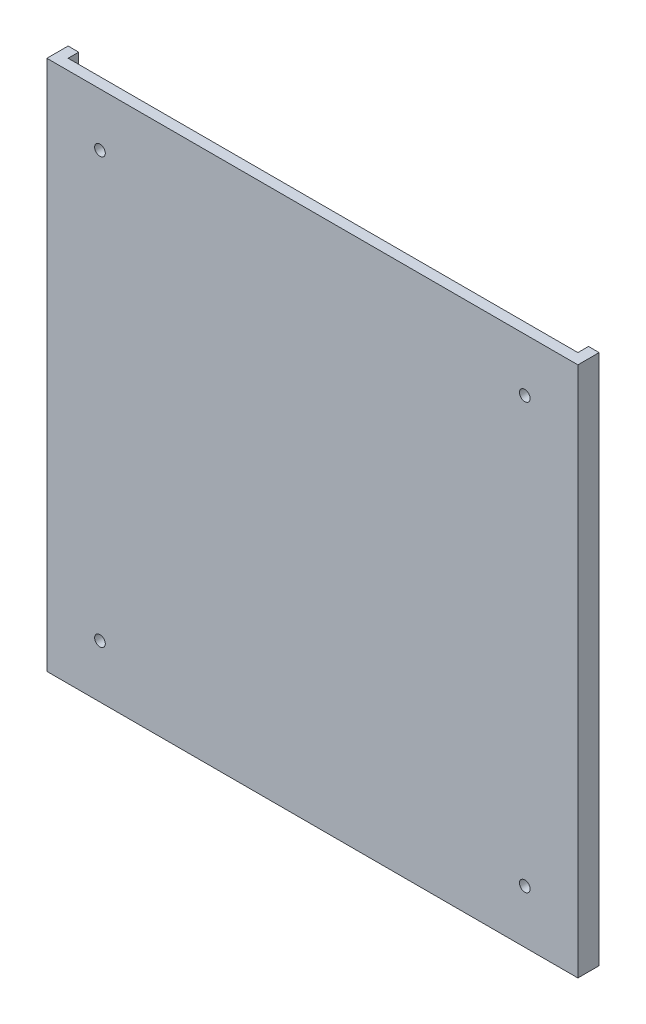
ISO-10303-21;
HEADER;
FILE_DESCRIPTION(('STEP AP214'),'2;1');
FILE_NAME('part.step','',(''),(''),'','','');
FILE_SCHEMA(('AUTOMOTIVE_DESIGN { 1 0 10303 214 1 1 1 1 }'));
ENDSEC;
DATA;
#1=APPLICATION_CONTEXT('core data for automotive mechanical design processes');
#2=APPLICATION_PROTOCOL_DEFINITION('international standard','automotive_design',2000,#1);
#3=PRODUCT_CONTEXT('',#1,'mechanical');
#4=PRODUCT('Part','Part','',(#3));
#5=PRODUCT_RELATED_PRODUCT_CATEGORY('part','',(#4));
#6=PRODUCT_DEFINITION_FORMATION('','',#4);
#7=PRODUCT_DEFINITION_CONTEXT('part definition',#1,'design');
#8=PRODUCT_DEFINITION('design','',#6,#7);
#9=PRODUCT_DEFINITION_SHAPE('','',#8);
#10=(LENGTH_UNIT() NAMED_UNIT(*) SI_UNIT(.MILLI.,.METRE.));
#11=(NAMED_UNIT(*) PLANE_ANGLE_UNIT() SI_UNIT($,.RADIAN.));
#12=(NAMED_UNIT(*) SI_UNIT($,.STERADIAN.) SOLID_ANGLE_UNIT());
#13=UNCERTAINTY_MEASURE_WITH_UNIT(LENGTH_MEASURE(1.E-05),#10,'distance_accuracy_value','');
#14=(GEOMETRIC_REPRESENTATION_CONTEXT(3) GLOBAL_UNCERTAINTY_ASSIGNED_CONTEXT((#13)) GLOBAL_UNIT_ASSIGNED_CONTEXT((#10,
#11,#12)) REPRESENTATION_CONTEXT('',''));
#15=CARTESIAN_POINT('',(0.,0.,0.));
#16=DIRECTION('',(0.,0.,1.));
#17=DIRECTION('',(1.,0.,0.));
#18=AXIS2_PLACEMENT_3D('',#15,#16,#17);
#19=CARTESIAN_POINT('',(0.,0.,0.));
#20=DIRECTION('',(0.,0.,-1.));
#21=DIRECTION('',(-1.,0.,0.));
#22=AXIS2_PLACEMENT_3D('',#19,#20,#21);
#23=PLANE('',#22);
#24=DIRECTION('',(0.,1.,0.));
#25=VECTOR('',#24,1.);
#26=CARTESIAN_POINT('',(-240.,-250.,0.));
#27=LINE('',#26,#25);
#28=CARTESIAN_POINT('',(-240.,-250.,0.));
#29=VERTEX_POINT('',#28);
#30=CARTESIAN_POINT('',(-240.,250.,0.));
#31=VERTEX_POINT('',#30);
#32=EDGE_CURVE('E143',#29,#31,#27,.T.);
#33=ORIENTED_EDGE('',*,*,#32,.F.);
#34=DIRECTION('',(1.,0.,0.));
#35=VECTOR('',#34,1.);
#36=CARTESIAN_POINT('',(-250.,-250.,0.));
#37=LINE('',#36,#35);
#38=CARTESIAN_POINT('',(-250.,-250.,0.));
#39=VERTEX_POINT('',#38);
#40=EDGE_CURVE('E131',#39,#29,#37,.T.);
#41=ORIENTED_EDGE('',*,*,#40,.F.);
#42=DIRECTION('',(0.,-1.,0.));
#43=VECTOR('',#42,1.);
#44=CARTESIAN_POINT('',(-250.,-250.,0.));
#45=LINE('',#44,#43);
#46=CARTESIAN_POINT('',(-250.,250.,0.));
#47=VERTEX_POINT('',#46);
#48=EDGE_CURVE('E162',#47,#39,#45,.T.);
#49=ORIENTED_EDGE('',*,*,#48,.F.);
#50=DIRECTION('',(-1.,0.,0.));
#51=VECTOR('',#50,1.);
#52=CARTESIAN_POINT('',(-250.,250.,0.));
#53=LINE('',#52,#51);
#54=EDGE_CURVE('E158',#31,#47,#53,.T.);
#55=ORIENTED_EDGE('',*,*,#54,.F.);
#56=EDGE_LOOP('',(#33,#41,#49,#55));
#57=FACE_BOUND('',#56,.T.);
#58=ADVANCED_FACE('F35',(#57),#23,.T.);
#59=CARTESIAN_POINT('',(250.,-250.,20.));
#60=DIRECTION('',(-1.,0.,0.));
#61=DIRECTION('',(0.,0.,1.));
#62=AXIS2_PLACEMENT_3D('',#59,#60,#61);
#63=PLANE('',#62);
#64=DIRECTION('',(0.,1.,0.));
#65=VECTOR('',#64,1.);
#66=CARTESIAN_POINT('',(250.,-250.,0.));
#67=LINE('',#66,#65);
#68=CARTESIAN_POINT('',(250.,-250.,0.));
#69=VERTEX_POINT('',#68);
#70=CARTESIAN_POINT('',(250.,250.,0.));
#71=VERTEX_POINT('',#70);
#72=EDGE_CURVE('E145',#69,#71,#67,.T.);
#73=ORIENTED_EDGE('',*,*,#72,.T.);
#74=DIRECTION('',(0.,0.,-1.));
#75=VECTOR('',#74,1.);
#76=CARTESIAN_POINT('',(250.,250.,20.));
#77=LINE('',#76,#75);
#78=CARTESIAN_POINT('',(250.,250.,20.));
#79=VERTEX_POINT('',#78);
#80=EDGE_CURVE('E11',#79,#71,#77,.T.);
#81=ORIENTED_EDGE('',*,*,#80,.F.);
#82=DIRECTION('',(0.,1.,0.));
#83=VECTOR('',#82,1.);
#84=CARTESIAN_POINT('',(250.,-250.,20.));
#85=LINE('',#84,#83);
#86=CARTESIAN_POINT('',(250.,-250.,20.));
#87=VERTEX_POINT('',#86);
#88=EDGE_CURVE('E149',#87,#79,#85,.T.);
#89=ORIENTED_EDGE('',*,*,#88,.F.);
#90=DIRECTION('',(0.,0.,-1.));
#91=VECTOR('',#90,1.);
#92=CARTESIAN_POINT('',(250.,-250.,20.));
#93=LINE('',#92,#91);
#94=EDGE_CURVE('E155',#87,#69,#93,.T.);
#95=ORIENTED_EDGE('',*,*,#94,.T.);
#96=EDGE_LOOP('',(#73,#81,#89,#95));
#97=FACE_BOUND('',#96,.T.);
#98=ADVANCED_FACE('F37',(#97),#63,.F.);
#99=CARTESIAN_POINT('',(-250.,250.,20.));
#100=DIRECTION('',(0.,-1.,0.));
#101=DIRECTION('',(0.,0.,-1.));
#102=AXIS2_PLACEMENT_3D('',#99,#100,#101);
#103=PLANE('',#102);
#104=DIRECTION('',(1.,0.,0.));
#105=VECTOR('',#104,1.);
#106=CARTESIAN_POINT('',(-240.,250.,10.));
#107=LINE('',#106,#105);
#108=CARTESIAN_POINT('',(-240.,250.,10.));
#109=VERTEX_POINT('',#108);
#110=CARTESIAN_POINT('',(240.,250.,10.));
#111=VERTEX_POINT('',#110);
#112=EDGE_CURVE('E133',#109,#111,#107,.T.);
#113=ORIENTED_EDGE('',*,*,#112,.F.);
#114=DIRECTION('',(0.,0.,1.));
#115=VECTOR('',#114,1.);
#116=CARTESIAN_POINT('',(-240.,250.,0.));
#117=LINE('',#116,#115);
#118=EDGE_CURVE('E115',#31,#109,#117,.T.);
#119=ORIENTED_EDGE('',*,*,#118,.F.);
#120=ORIENTED_EDGE('',*,*,#54,.T.);
#121=DIRECTION('',(0.,0.,-1.));
#122=VECTOR('',#121,1.);
#123=CARTESIAN_POINT('',(-250.,250.,20.));
#124=LINE('',#123,#122);
#125=CARTESIAN_POINT('',(-250.,250.,20.));
#126=VERTEX_POINT('',#125);
#127=EDGE_CURVE('E43',#126,#47,#124,.T.);
#128=ORIENTED_EDGE('',*,*,#127,.F.);
#129=DIRECTION('',(-1.,0.,0.));
#130=VECTOR('',#129,1.);
#131=CARTESIAN_POINT('',(-250.,250.,20.));
#132=LINE('',#131,#130);
#133=EDGE_CURVE('E87',#79,#126,#132,.T.);
#134=ORIENTED_EDGE('',*,*,#133,.F.);
#135=ORIENTED_EDGE('',*,*,#80,.T.);
#136=CARTESIAN_POINT('',(240.,250.,0.));
#137=VERTEX_POINT('',#136);
#138=EDGE_CURVE('E159',#71,#137,#53,.T.);
#139=ORIENTED_EDGE('',*,*,#138,.T.);
#140=DIRECTION('',(0.,0.,-1.));
#141=VECTOR('',#140,1.);
#142=CARTESIAN_POINT('',(240.,250.,0.));
#143=LINE('',#142,#141);
#144=EDGE_CURVE('E50',#111,#137,#143,.T.);
#145=ORIENTED_EDGE('',*,*,#144,.F.);
#146=EDGE_LOOP('',(#113,#119,#120,#128,#134,#135,#139,#145));
#147=FACE_BOUND('',#146,.T.);
#148=ADVANCED_FACE('F175',(#147),#103,.F.);
#149=CARTESIAN_POINT('',(-250.,-250.,20.));
#150=DIRECTION('',(1.,0.,0.));
#151=DIRECTION('',(0.,0.,-1.));
#152=AXIS2_PLACEMENT_3D('',#149,#150,#151);
#153=PLANE('',#152);
#154=ORIENTED_EDGE('',*,*,#48,.T.);
#155=DIRECTION('',(0.,0.,-1.));
#156=VECTOR('',#155,1.);
#157=CARTESIAN_POINT('',(-250.,-250.,20.));
#158=LINE('',#157,#156);
#159=CARTESIAN_POINT('',(-250.,-250.,20.));
#160=VERTEX_POINT('',#159);
#161=EDGE_CURVE('E166',#160,#39,#158,.T.);
#162=ORIENTED_EDGE('',*,*,#161,.F.);
#163=DIRECTION('',(0.,-1.,0.));
#164=VECTOR('',#163,1.);
#165=CARTESIAN_POINT('',(-250.,-250.,20.));
#166=LINE('',#165,#164);
#167=EDGE_CURVE('E152',#126,#160,#166,.T.);
#168=ORIENTED_EDGE('',*,*,#167,.F.);
#169=ORIENTED_EDGE('',*,*,#127,.T.);
#170=EDGE_LOOP('',(#154,#162,#168,#169));
#171=FACE_BOUND('',#170,.T.);
#172=ADVANCED_FACE('F171',(#171),#153,.F.);
#173=CARTESIAN_POINT('',(-250.,-250.,20.));
#174=DIRECTION('',(0.,1.,0.));
#175=DIRECTION('',(0.,0.,1.));
#176=AXIS2_PLACEMENT_3D('',#173,#174,#175);
#177=PLANE('',#176);
#178=ORIENTED_EDGE('',*,*,#40,.T.);
#179=DIRECTION('',(0.,0.,1.));
#180=VECTOR('',#179,1.);
#181=CARTESIAN_POINT('',(-240.,-250.,0.));
#182=LINE('',#181,#180);
#183=CARTESIAN_POINT('',(-240.,-250.,10.));
#184=VERTEX_POINT('',#183);
#185=EDGE_CURVE('E112',#29,#184,#182,.T.);
#186=ORIENTED_EDGE('',*,*,#185,.T.);
#187=DIRECTION('',(1.,0.,0.));
#188=VECTOR('',#187,1.);
#189=CARTESIAN_POINT('',(-240.,-250.,10.));
#190=LINE('',#189,#188);
#191=CARTESIAN_POINT('',(240.,-250.,10.));
#192=VERTEX_POINT('',#191);
#193=EDGE_CURVE('E123',#184,#192,#190,.T.);
#194=ORIENTED_EDGE('',*,*,#193,.T.);
#195=DIRECTION('',(0.,0.,-1.));
#196=VECTOR('',#195,1.);
#197=CARTESIAN_POINT('',(240.,-250.,0.));
#198=LINE('',#197,#196);
#199=CARTESIAN_POINT('',(240.,-250.,0.));
#200=VERTEX_POINT('',#199);
#201=EDGE_CURVE('E120',#192,#200,#198,.T.);
#202=ORIENTED_EDGE('',*,*,#201,.T.);
#203=EDGE_CURVE('E80',#200,#69,#37,.T.);
#204=ORIENTED_EDGE('',*,*,#203,.T.);
#205=ORIENTED_EDGE('',*,*,#94,.F.);
#206=DIRECTION('',(1.,0.,0.));
#207=VECTOR('',#206,1.);
#208=CARTESIAN_POINT('',(-250.,-250.,20.));
#209=LINE('',#208,#207);
#210=EDGE_CURVE('E59',#160,#87,#209,.T.);
#211=ORIENTED_EDGE('',*,*,#210,.F.);
#212=ORIENTED_EDGE('',*,*,#161,.T.);
#213=EDGE_LOOP('',(#178,#186,#194,#202,#204,#205,#211,#212));
#214=FACE_BOUND('',#213,.T.);
#215=ADVANCED_FACE('F128',(#214),#177,.F.);
#216=CARTESIAN_POINT('',(0.,0.,20.));
#217=DIRECTION('',(0.,0.,-1.));
#218=DIRECTION('',(-1.,0.,0.));
#219=AXIS2_PLACEMENT_3D('',#216,#217,#218);
#220=PLANE('',#219);
#221=CARTESIAN_POINT('',(200.,-200.,20.));
#222=DIRECTION('',(0.,0.,1.));
#223=DIRECTION('',(1.,0.,0.));
#224=AXIS2_PLACEMENT_3D('',#221,#222,#223);
#225=CIRCLE('',#224,4.99999999999999);
#226=CARTESIAN_POINT('',(205.,-200.,20.));
#227=VERTEX_POINT('',#226);
#228=EDGE_CURVE('E214',#227,#227,#225,.T.);
#229=ORIENTED_EDGE('',*,*,#228,.F.);
#230=EDGE_LOOP('',(#229));
#231=FACE_BOUND('',#230,.T.);
#232=CARTESIAN_POINT('',(-200.,-200.,20.));
#233=DIRECTION('',(0.,0.,1.));
#234=DIRECTION('',(1.,0.,0.));
#235=AXIS2_PLACEMENT_3D('',#232,#233,#234);
#236=CIRCLE('',#235,4.99999999999999);
#237=CARTESIAN_POINT('',(-195.,-200.,20.));
#238=VERTEX_POINT('',#237);
#239=EDGE_CURVE('E218',#238,#238,#236,.T.);
#240=ORIENTED_EDGE('',*,*,#239,.F.);
#241=EDGE_LOOP('',(#240));
#242=FACE_BOUND('',#241,.T.);
#243=CARTESIAN_POINT('',(200.,200.,20.));
#244=DIRECTION('',(0.,0.,1.));
#245=DIRECTION('',(1.,0.,0.));
#246=AXIS2_PLACEMENT_3D('',#243,#244,#245);
#247=CIRCLE('',#246,4.99999999999999);
#248=CARTESIAN_POINT('',(205.,200.,20.));
#249=VERTEX_POINT('',#248);
#250=EDGE_CURVE('E222',#249,#249,#247,.T.);
#251=ORIENTED_EDGE('',*,*,#250,.F.);
#252=EDGE_LOOP('',(#251));
#253=FACE_BOUND('',#252,.T.);
#254=CARTESIAN_POINT('',(-200.,200.,20.));
#255=DIRECTION('',(0.,0.,1.));
#256=DIRECTION('',(1.,0.,0.));
#257=AXIS2_PLACEMENT_3D('',#254,#255,#256);
#258=CIRCLE('',#257,4.99999999999999);
#259=CARTESIAN_POINT('',(-195.,200.,20.));
#260=VERTEX_POINT('',#259);
#261=EDGE_CURVE('E136',#260,#260,#258,.T.);
#262=ORIENTED_EDGE('',*,*,#261,.F.);
#263=EDGE_LOOP('',(#262));
#264=FACE_BOUND('',#263,.T.);
#265=ORIENTED_EDGE('',*,*,#88,.T.);
#266=ORIENTED_EDGE('',*,*,#133,.T.);
#267=ORIENTED_EDGE('',*,*,#167,.T.);
#268=ORIENTED_EDGE('',*,*,#210,.T.);
#269=EDGE_LOOP('',(#265,#266,#267,#268));
#270=FACE_BOUND('',#269,.T.);
#271=ADVANCED_FACE('F202',(#231,#242,#253,#264,#270),#220,.F.);
#272=DIRECTION('',(0.,1.,0.));
#273=VECTOR('',#272,1.);
#274=CARTESIAN_POINT('',(240.,-250.,0.));
#275=LINE('',#274,#273);
#276=EDGE_CURVE('E146',#200,#137,#275,.T.);
#277=ORIENTED_EDGE('',*,*,#276,.T.);
#278=ORIENTED_EDGE('',*,*,#138,.F.);
#279=ORIENTED_EDGE('',*,*,#72,.F.);
#280=ORIENTED_EDGE('',*,*,#203,.F.);
#281=EDGE_LOOP('',(#277,#278,#279,#280));
#282=FACE_BOUND('',#281,.T.);
#283=ADVANCED_FACE('F179',(#282),#23,.T.);
#284=CARTESIAN_POINT('',(-240.,-250.,0.));
#285=DIRECTION('',(-1.,0.,0.));
#286=DIRECTION('',(0.,0.,1.));
#287=AXIS2_PLACEMENT_3D('',#284,#285,#286);
#288=PLANE('',#287);
#289=ORIENTED_EDGE('',*,*,#118,.T.);
#290=DIRECTION('',(0.,1.,0.));
#291=VECTOR('',#290,1.);
#292=CARTESIAN_POINT('',(-240.,-250.,10.));
#293=LINE('',#292,#291);
#294=EDGE_CURVE('E108',#184,#109,#293,.T.);
#295=ORIENTED_EDGE('',*,*,#294,.F.);
#296=ORIENTED_EDGE('',*,*,#185,.F.);
#297=ORIENTED_EDGE('',*,*,#32,.T.);
#298=EDGE_LOOP('',(#289,#295,#296,#297));
#299=FACE_BOUND('',#298,.T.);
#300=ADVANCED_FACE('F110',(#299),#288,.F.);
#301=CARTESIAN_POINT('',(240.,-250.,0.));
#302=DIRECTION('',(1.,0.,0.));
#303=DIRECTION('',(0.,0.,-1.));
#304=AXIS2_PLACEMENT_3D('',#301,#302,#303);
#305=PLANE('',#304);
#306=ORIENTED_EDGE('',*,*,#144,.T.);
#307=ORIENTED_EDGE('',*,*,#276,.F.);
#308=ORIENTED_EDGE('',*,*,#201,.F.);
#309=DIRECTION('',(0.,1.,0.));
#310=VECTOR('',#309,1.);
#311=CARTESIAN_POINT('',(240.,-250.,10.));
#312=LINE('',#311,#310);
#313=EDGE_CURVE('E119',#192,#111,#312,.T.);
#314=ORIENTED_EDGE('',*,*,#313,.T.);
#315=EDGE_LOOP('',(#306,#307,#308,#314));
#316=FACE_BOUND('',#315,.T.);
#317=ADVANCED_FACE('F180',(#316),#305,.F.);
#318=CARTESIAN_POINT('',(-240.,-250.,10.));
#319=DIRECTION('',(0.,0.,1.));
#320=DIRECTION('',(1.,0.,0.));
#321=AXIS2_PLACEMENT_3D('',#318,#319,#320);
#322=PLANE('',#321);
#323=CARTESIAN_POINT('',(200.,-200.,10.));
#324=DIRECTION('',(0.,0.,1.));
#325=DIRECTION('',(1.,0.,0.));
#326=AXIS2_PLACEMENT_3D('',#323,#324,#325);
#327=CIRCLE('',#326,4.99999999999999);
#328=CARTESIAN_POINT('',(205.,-200.,10.));
#329=VERTEX_POINT('',#328);
#330=EDGE_CURVE('E237',#329,#329,#327,.T.);
#331=ORIENTED_EDGE('',*,*,#330,.T.);
#332=EDGE_LOOP('',(#331));
#333=FACE_BOUND('',#332,.T.);
#334=CARTESIAN_POINT('',(-200.,-200.,10.));
#335=DIRECTION('',(0.,0.,1.));
#336=DIRECTION('',(1.,0.,0.));
#337=AXIS2_PLACEMENT_3D('',#334,#335,#336);
#338=CIRCLE('',#337,4.99999999999999);
#339=CARTESIAN_POINT('',(-195.,-200.,10.));
#340=VERTEX_POINT('',#339);
#341=EDGE_CURVE('E233',#340,#340,#338,.T.);
#342=ORIENTED_EDGE('',*,*,#341,.T.);
#343=EDGE_LOOP('',(#342));
#344=FACE_BOUND('',#343,.T.);
#345=CARTESIAN_POINT('',(200.,200.,10.));
#346=DIRECTION('',(0.,0.,1.));
#347=DIRECTION('',(1.,0.,0.));
#348=AXIS2_PLACEMENT_3D('',#345,#346,#347);
#349=CIRCLE('',#348,4.99999999999999);
#350=CARTESIAN_POINT('',(205.,200.,10.));
#351=VERTEX_POINT('',#350);
#352=EDGE_CURVE('E227',#351,#351,#349,.T.);
#353=ORIENTED_EDGE('',*,*,#352,.T.);
#354=EDGE_LOOP('',(#353));
#355=FACE_BOUND('',#354,.T.);
#356=CARTESIAN_POINT('',(-200.,200.,10.));
#357=DIRECTION('',(0.,0.,1.));
#358=DIRECTION('',(1.,0.,0.));
#359=AXIS2_PLACEMENT_3D('',#356,#357,#358);
#360=CIRCLE('',#359,4.99999999999999);
#361=CARTESIAN_POINT('',(-195.,200.,10.));
#362=VERTEX_POINT('',#361);
#363=EDGE_CURVE('E141',#362,#362,#360,.T.);
#364=ORIENTED_EDGE('',*,*,#363,.T.);
#365=EDGE_LOOP('',(#364));
#366=FACE_BOUND('',#365,.T.);
#367=ORIENTED_EDGE('',*,*,#112,.T.);
#368=ORIENTED_EDGE('',*,*,#313,.F.);
#369=ORIENTED_EDGE('',*,*,#193,.F.);
#370=ORIENTED_EDGE('',*,*,#294,.T.);
#371=EDGE_LOOP('',(#367,#368,#369,#370));
#372=FACE_BOUND('',#371,.T.);
#373=ADVANCED_FACE('F124',(#333,#344,#355,#366,#372),#322,.F.);
#374=CARTESIAN_POINT('',(-200.,200.,10.));
#375=DIRECTION('',(0.,0.,1.));
#376=DIRECTION('',(1.,0.,0.));
#377=AXIS2_PLACEMENT_3D('',#374,#375,#376);
#378=CYLINDRICAL_SURFACE('',#377,4.99999999999999);
#379=ORIENTED_EDGE('',*,*,#363,.F.);
#380=EDGE_LOOP('',(#379));
#381=FACE_BOUND('',#380,.T.);
#382=ORIENTED_EDGE('',*,*,#261,.T.);
#383=EDGE_LOOP('',(#382));
#384=FACE_BOUND('',#383,.T.);
#385=ADVANCED_FACE('F188',(#381,#384),#378,.F.);
#386=CARTESIAN_POINT('',(200.,200.,10.));
#387=DIRECTION('',(0.,0.,1.));
#388=DIRECTION('',(1.,0.,0.));
#389=AXIS2_PLACEMENT_3D('',#386,#387,#388);
#390=CYLINDRICAL_SURFACE('',#389,4.99999999999999);
#391=ORIENTED_EDGE('',*,*,#352,.F.);
#392=EDGE_LOOP('',(#391));
#393=FACE_BOUND('',#392,.T.);
#394=ORIENTED_EDGE('',*,*,#250,.T.);
#395=EDGE_LOOP('',(#394));
#396=FACE_BOUND('',#395,.T.);
#397=ADVANCED_FACE('F253',(#393,#396),#390,.F.);
#398=CARTESIAN_POINT('',(-200.,-200.,10.));
#399=DIRECTION('',(0.,0.,1.));
#400=DIRECTION('',(1.,0.,0.));
#401=AXIS2_PLACEMENT_3D('',#398,#399,#400);
#402=CYLINDRICAL_SURFACE('',#401,4.99999999999999);
#403=ORIENTED_EDGE('',*,*,#341,.F.);
#404=EDGE_LOOP('',(#403));
#405=FACE_BOUND('',#404,.T.);
#406=ORIENTED_EDGE('',*,*,#239,.T.);
#407=EDGE_LOOP('',(#406));
#408=FACE_BOUND('',#407,.T.);
#409=ADVANCED_FACE('F248',(#405,#408),#402,.F.);
#410=CARTESIAN_POINT('',(200.,-200.,10.));
#411=DIRECTION('',(0.,0.,1.));
#412=DIRECTION('',(1.,0.,0.));
#413=AXIS2_PLACEMENT_3D('',#410,#411,#412);
#414=CYLINDRICAL_SURFACE('',#413,4.99999999999999);
#415=ORIENTED_EDGE('',*,*,#330,.F.);
#416=EDGE_LOOP('',(#415));
#417=FACE_BOUND('',#416,.T.);
#418=ORIENTED_EDGE('',*,*,#228,.T.);
#419=EDGE_LOOP('',(#418));
#420=FACE_BOUND('',#419,.T.);
#421=ADVANCED_FACE('F245',(#417,#420),#414,.F.);
#422=CLOSED_SHELL('',(#58,#98,#148,#172,#215,#271,#283,#300,#317,#373,#385,#397,#409,#421));
#423=MANIFOLD_SOLID_BREP('B2',#422);
#424=ADVANCED_BREP_SHAPE_REPRESENTATION('',(#18,#423),#14);
#425=SHAPE_DEFINITION_REPRESENTATION(#9,#424);
ENDSEC;
END-ISO-10303-21;
